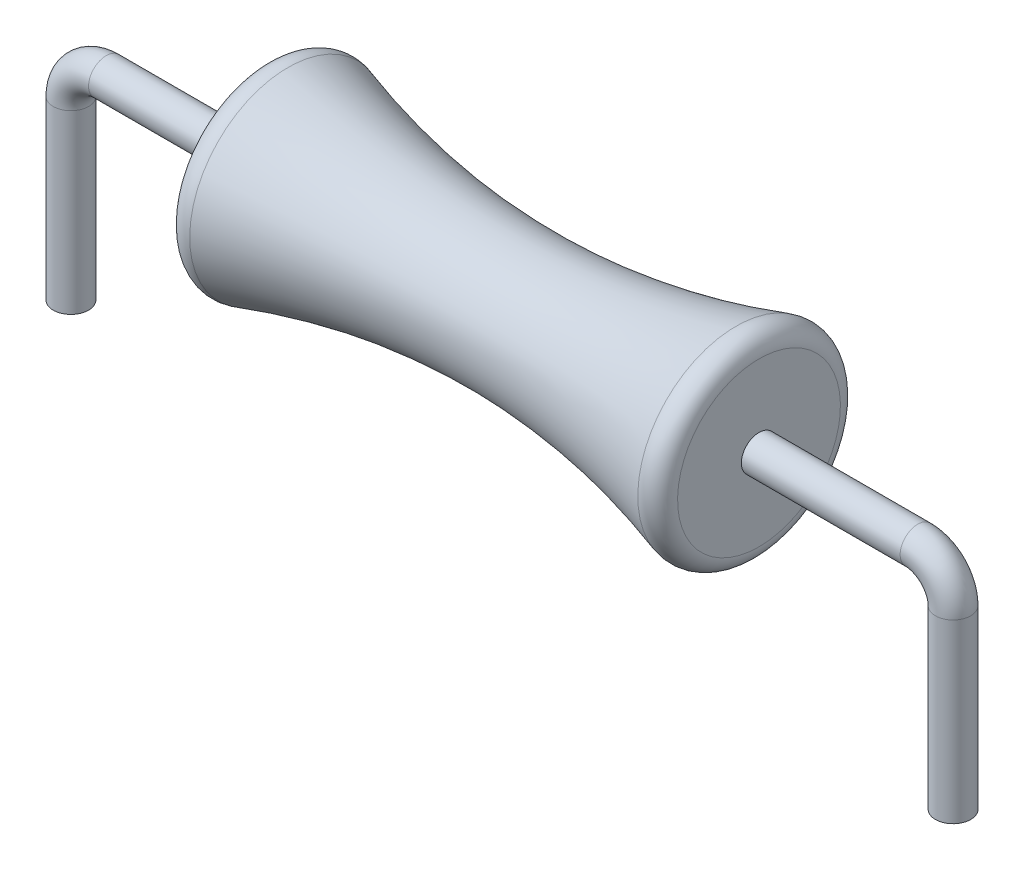
ISO-10303-21;
HEADER;
FILE_DESCRIPTION(('STEP AP214'),'2;1');
FILE_NAME('part.step','',(''),(''),'','','');
FILE_SCHEMA(('AUTOMOTIVE_DESIGN { 1 0 10303 214 1 1 1 1 }'));
ENDSEC;
DATA;
#1=APPLICATION_CONTEXT('core data for automotive mechanical design processes');
#2=APPLICATION_PROTOCOL_DEFINITION('international standard','automotive_design',2000,#1);
#3=PRODUCT_CONTEXT('',#1,'mechanical');
#4=PRODUCT('Part','Part','',(#3));
#5=PRODUCT_RELATED_PRODUCT_CATEGORY('part','',(#4));
#6=PRODUCT_DEFINITION_FORMATION('','',#4);
#7=PRODUCT_DEFINITION_CONTEXT('part definition',#1,'design');
#8=PRODUCT_DEFINITION('design','',#6,#7);
#9=PRODUCT_DEFINITION_SHAPE('','',#8);
#10=(LENGTH_UNIT() NAMED_UNIT(*) SI_UNIT(.MILLI.,.METRE.));
#11=(NAMED_UNIT(*) PLANE_ANGLE_UNIT() SI_UNIT($,.RADIAN.));
#12=(NAMED_UNIT(*) SI_UNIT($,.STERADIAN.) SOLID_ANGLE_UNIT());
#13=UNCERTAINTY_MEASURE_WITH_UNIT(LENGTH_MEASURE(1.E-05),#10,'distance_accuracy_value','');
#14=(GEOMETRIC_REPRESENTATION_CONTEXT(3) GLOBAL_UNCERTAINTY_ASSIGNED_CONTEXT((#13)) GLOBAL_UNIT_ASSIGNED_CONTEXT((#10,
#11,#12)) REPRESENTATION_CONTEXT('',''));
#15=CARTESIAN_POINT('',(0.,0.,0.));
#16=DIRECTION('',(0.,0.,1.));
#17=DIRECTION('',(1.,0.,0.));
#18=AXIS2_PLACEMENT_3D('',#15,#16,#17);
#19=CARTESIAN_POINT('',(3.5,0.,0.));
#20=DIRECTION('',(-1.,0.,0.));
#21=DIRECTION('',(0.,-1.,0.));
#22=AXIS2_PLACEMENT_3D('',#19,#20,#21);
#23=PLANE('',#22);
#24=CARTESIAN_POINT('',(3.5,0.,0.));
#25=DIRECTION('',(-1.,0.,0.));
#26=DIRECTION('',(0.,-1.,0.));
#27=AXIS2_PLACEMENT_3D('',#24,#25,#26);
#28=CIRCLE('',#27,1.15370622549942);
#29=CARTESIAN_POINT('',(3.5,-1.15370622549942,0.));
#30=VERTEX_POINT('',#29);
#31=EDGE_CURVE('E41',#30,#30,#28,.F.);
#32=ORIENTED_EDGE('',*,*,#31,.T.);
#33=EDGE_LOOP('',(#32));
#34=FACE_BOUND('',#33,.T.);
#35=CARTESIAN_POINT('',(3.5,0.,0.));
#36=DIRECTION('',(-1.,0.,0.));
#37=DIRECTION('',(0.,-1.,0.));
#38=AXIS2_PLACEMENT_3D('',#35,#36,#37);
#39=CIRCLE('',#38,0.25);
#40=CARTESIAN_POINT('',(3.5,-0.249999999999999,0.));
#41=VERTEX_POINT('',#40);
#42=EDGE_CURVE('E10',#41,#41,#39,.F.);
#43=ORIENTED_EDGE('',*,*,#42,.F.);
#44=EDGE_LOOP('',(#43));
#45=FACE_BOUND('',#44,.T.);
#46=ADVANCED_FACE('F34',(#34,#45),#23,.F.);
#47=CARTESIAN_POINT('',(-3.5,0.,0.));
#48=DIRECTION('',(1.,0.,0.));
#49=DIRECTION('',(0.,1.,0.));
#50=AXIS2_PLACEMENT_3D('',#47,#48,#49);
#51=PLANE('',#50);
#52=CARTESIAN_POINT('',(-3.5,0.,0.));
#53=DIRECTION('',(1.,0.,0.));
#54=DIRECTION('',(0.,1.,0.));
#55=AXIS2_PLACEMENT_3D('',#52,#53,#54);
#56=CIRCLE('',#55,0.25);
#57=CARTESIAN_POINT('',(-3.5,0.250000000000001,0.));
#58=VERTEX_POINT('',#57);
#59=EDGE_CURVE('E217',#58,#58,#56,.T.);
#60=ORIENTED_EDGE('',*,*,#59,.T.);
#61=EDGE_LOOP('',(#60));
#62=FACE_BOUND('',#61,.T.);
#63=CARTESIAN_POINT('',(-3.5,0.,0.));
#64=DIRECTION('',(1.,0.,0.));
#65=DIRECTION('',(0.,1.,0.));
#66=AXIS2_PLACEMENT_3D('',#63,#64,#65);
#67=CIRCLE('',#66,1.15370622549943);
#68=CARTESIAN_POINT('',(-3.5,1.15370622549943,0.));
#69=VERTEX_POINT('',#68);
#70=EDGE_CURVE('E54',#69,#69,#67,.F.);
#71=ORIENTED_EDGE('',*,*,#70,.T.);
#72=EDGE_LOOP('',(#71));
#73=FACE_BOUND('',#72,.T.);
#74=ADVANCED_FACE('F72',(#62,#73),#51,.F.);
#75=CARTESIAN_POINT('',(3.5,1.5,0.));
#76=CARTESIAN_POINT('',(0.,0.282452634750258,0.));
#77=CARTESIAN_POINT('',(-3.5,1.5,0.));
#78=B_SPLINE_CURVE_WITH_KNOTS('',2,(#75,#76,#77),.UNSPECIFIED.,.F.,.F.,(3,3),(0.,1.),.UNSPECIFIED.);
#79=CARTESIAN_POINT('',(-3.5,0.,0.));
#80=DIRECTION('',(-1.,0.,0.));
#81=AXIS1_PLACEMENT('',#79,#80);
#82=SURFACE_OF_REVOLUTION('',#78,#81);
#83=CARTESIAN_POINT('',(-3.17477004238228,0.,0.));
#84=DIRECTION('',(-1.,0.,0.));
#85=DIRECTION('',(0.,-1.,0.));
#86=AXIS2_PLACEMENT_3D('',#83,#84,#85);
#87=CIRCLE('',#86,1.39211858565896);
#88=CARTESIAN_POINT('',(-3.17477004238228,-1.39211858565896,0.));
#89=VERTEX_POINT('',#88);
#90=EDGE_CURVE('E45',#89,#89,#87,.F.);
#91=ORIENTED_EDGE('',*,*,#90,.T.);
#92=EDGE_LOOP('',(#91));
#93=FACE_BOUND('',#92,.T.);
#94=CARTESIAN_POINT('',(3.1747700423823,0.,0.));
#95=DIRECTION('',(-1.,0.,0.));
#96=DIRECTION('',(0.,-1.,0.));
#97=AXIS2_PLACEMENT_3D('',#94,#95,#96);
#98=CIRCLE('',#97,1.39211858565896);
#99=CARTESIAN_POINT('',(3.1747700423823,-1.39211858565896,0.));
#100=VERTEX_POINT('',#99);
#101=EDGE_CURVE('E49',#100,#100,#98,.T.);
#102=ORIENTED_EDGE('',*,*,#101,.T.);
#103=EDGE_LOOP('',(#102));
#104=FACE_BOUND('',#103,.T.);
#105=ADVANCED_FACE('F67',(#93,#104),#82,.T.);
#106=CARTESIAN_POINT('',(-3.24999999999999,0.,0.));
#107=DIRECTION('',(-1.,0.,0.));
#108=DIRECTION('',(0.,-1.,0.));
#109=AXIS2_PLACEMENT_3D('',#106,#107,#108);
#110=TOROIDAL_SURFACE('',#109,1.15370622549943,0.25);
#111=ORIENTED_EDGE('',*,*,#90,.F.);
#112=EDGE_LOOP('',(#111));
#113=FACE_BOUND('',#112,.T.);
#114=ORIENTED_EDGE('',*,*,#70,.F.);
#115=EDGE_LOOP('',(#114));
#116=FACE_BOUND('',#115,.T.);
#117=ADVANCED_FACE('F71',(#113,#116),#110,.T.);
#118=CARTESIAN_POINT('',(3.25,0.,0.));
#119=DIRECTION('',(-1.,0.,0.));
#120=DIRECTION('',(0.,-1.,0.));
#121=AXIS2_PLACEMENT_3D('',#118,#119,#120);
#122=TOROIDAL_SURFACE('',#121,1.15370622549942,0.25);
#123=ORIENTED_EDGE('',*,*,#31,.F.);
#124=EDGE_LOOP('',(#123));
#125=FACE_BOUND('',#124,.T.);
#126=ORIENTED_EDGE('',*,*,#101,.F.);
#127=EDGE_LOOP('',(#126));
#128=FACE_BOUND('',#127,.T.);
#129=ADVANCED_FACE('F36',(#125,#128),#122,.T.);
#130=CARTESIAN_POINT('',(6.25,-0.500000000000003,0.));
#131=DIRECTION('',(0.,-1.,0.));
#132=DIRECTION('',(1.,0.,0.));
#133=AXIS2_PLACEMENT_3D('',#130,#131,#132);
#134=CYLINDRICAL_SURFACE('',#133,0.25);
#135=CARTESIAN_POINT('',(6.25,-0.500000000000003,0.));
#136=DIRECTION('',(0.,-1.,0.));
#137=DIRECTION('',(1.,0.,0.));
#138=AXIS2_PLACEMENT_3D('',#135,#136,#137);
#139=CIRCLE('',#138,0.25);
#140=CARTESIAN_POINT('',(6.5,-0.500000000000005,0.));
#141=VERTEX_POINT('',#140);
#142=EDGE_CURVE('E205',#141,#141,#139,.T.);
#143=ORIENTED_EDGE('',*,*,#142,.T.);
#144=EDGE_LOOP('',(#143));
#145=FACE_BOUND('',#144,.T.);
#146=CARTESIAN_POINT('',(6.25,-3.,0.));
#147=DIRECTION('',(0.,-1.,0.));
#148=DIRECTION('',(1.,0.,0.));
#149=AXIS2_PLACEMENT_3D('',#146,#147,#148);
#150=CIRCLE('',#149,0.25);
#151=CARTESIAN_POINT('',(6.5,-3.,0.));
#152=VERTEX_POINT('',#151);
#153=EDGE_CURVE('E57',#152,#152,#150,.T.);
#154=ORIENTED_EDGE('',*,*,#153,.F.);
#155=EDGE_LOOP('',(#154));
#156=FACE_BOUND('',#155,.T.);
#157=ADVANCED_FACE('F82',(#145,#156),#134,.T.);
#158=CARTESIAN_POINT('',(5.75,-0.5,0.));
#159=DIRECTION('',(0.,0.,-1.));
#160=DIRECTION('',(-1.,0.,0.));
#161=AXIS2_PLACEMENT_3D('',#158,#159,#160);
#162=TOROIDAL_SURFACE('',#161,0.500000000000001,0.25);
#163=CARTESIAN_POINT('',(5.75,0.,0.));
#164=DIRECTION('',(1.,0.,0.));
#165=DIRECTION('',(0.,1.,0.));
#166=AXIS2_PLACEMENT_3D('',#163,#164,#165);
#167=CIRCLE('',#166,0.25);
#168=CARTESIAN_POINT('',(5.75,0.250000000000001,0.));
#169=VERTEX_POINT('',#168);
#170=EDGE_CURVE('E201',#169,#169,#167,.T.);
#171=CARTESIAN_POINT('',(5.75,-0.5,0.));
#172=DIRECTION('',(0.,0.,-1.));
#173=DIRECTION('',(-1.,0.,0.));
#174=AXIS2_PLACEMENT_3D('',#171,#172,#173);
#175=CIRCLE('',#174,0.750000000000001);
#176=EDGE_CURVE('',#169,#141,#175,.T.);
#177=ORIENTED_EDGE('',*,*,#170,.T.);
#178=ORIENTED_EDGE('',*,*,#142,.F.);
#179=ORIENTED_EDGE('',*,*,#176,.T.);
#180=ORIENTED_EDGE('',*,*,#176,.F.);
#181=EDGE_LOOP('',(#177,#179,#178,#180));
#182=FACE_BOUND('',#181,.T.);
#183=ADVANCED_FACE('F126',(#182),#162,.T.);
#184=CARTESIAN_POINT('',(5.75,0.,0.));
#185=DIRECTION('',(-1.,0.,0.));
#186=DIRECTION('',(0.,0.,1.));
#187=AXIS2_PLACEMENT_3D('',#184,#185,#186);
#188=CYLINDRICAL_SURFACE('',#187,0.25);
#189=ORIENTED_EDGE('',*,*,#170,.F.);
#190=EDGE_LOOP('',(#189));
#191=FACE_BOUND('',#190,.T.);
#192=ORIENTED_EDGE('',*,*,#42,.T.);
#193=EDGE_LOOP('',(#192));
#194=FACE_BOUND('',#193,.T.);
#195=ADVANCED_FACE('F135',(#191,#194),#188,.T.);
#196=CARTESIAN_POINT('',(6.25,-3.,0.));
#197=DIRECTION('',(0.,-1.,0.));
#198=DIRECTION('',(1.,0.,0.));
#199=AXIS2_PLACEMENT_3D('',#196,#197,#198);
#200=PLANE('',#199);
#201=ORIENTED_EDGE('',*,*,#153,.T.);
#202=EDGE_LOOP('',(#201));
#203=FACE_BOUND('',#202,.T.);
#204=ADVANCED_FACE('F144',(#203),#200,.T.);
#205=CARTESIAN_POINT('',(-6.25,-0.500000000000003,0.));
#206=DIRECTION('',(0.,-1.,0.));
#207=DIRECTION('',(1.,0.,0.));
#208=AXIS2_PLACEMENT_3D('',#205,#206,#207);
#209=CYLINDRICAL_SURFACE('',#208,0.25);
#210=CARTESIAN_POINT('',(-6.25,-0.500000000000003,0.));
#211=DIRECTION('',(0.,1.,0.));
#212=DIRECTION('',(-1.,0.,0.));
#213=AXIS2_PLACEMENT_3D('',#210,#211,#212);
#214=CIRCLE('',#213,0.25);
#215=CARTESIAN_POINT('',(-6.5,-0.500000000000005,0.));
#216=VERTEX_POINT('',#215);
#217=EDGE_CURVE('E202',#216,#216,#214,.T.);
#218=ORIENTED_EDGE('',*,*,#217,.F.);
#219=EDGE_LOOP('',(#218));
#220=FACE_BOUND('',#219,.T.);
#221=CARTESIAN_POINT('',(-6.25,-3.,0.));
#222=DIRECTION('',(0.,1.,0.));
#223=DIRECTION('',(-1.,0.,0.));
#224=AXIS2_PLACEMENT_3D('',#221,#222,#223);
#225=CIRCLE('',#224,0.25);
#226=CARTESIAN_POINT('',(-6.5,-3.,0.));
#227=VERTEX_POINT('',#226);
#228=EDGE_CURVE('E199',#227,#227,#225,.T.);
#229=ORIENTED_EDGE('',*,*,#228,.T.);
#230=EDGE_LOOP('',(#229));
#231=FACE_BOUND('',#230,.T.);
#232=ADVANCED_FACE('F153',(#220,#231),#209,.T.);
#233=CARTESIAN_POINT('',(-5.75,-0.5,0.));
#234=DIRECTION('',(0.,0.,1.));
#235=DIRECTION('',(1.,0.,0.));
#236=AXIS2_PLACEMENT_3D('',#233,#234,#235);
#237=TOROIDAL_SURFACE('',#236,0.500000000000001,0.25);
#238=CARTESIAN_POINT('',(-5.75,0.,0.));
#239=DIRECTION('',(1.,0.,0.));
#240=DIRECTION('',(0.,1.,0.));
#241=AXIS2_PLACEMENT_3D('',#238,#239,#240);
#242=CIRCLE('',#241,0.25);
#243=CARTESIAN_POINT('',(-5.75,0.250000000000001,0.));
#244=VERTEX_POINT('',#243);
#245=EDGE_CURVE('E208',#244,#244,#242,.T.);
#246=CARTESIAN_POINT('',(-5.75,-0.5,0.));
#247=DIRECTION('',(0.,0.,1.));
#248=DIRECTION('',(1.,0.,0.));
#249=AXIS2_PLACEMENT_3D('',#246,#247,#248);
#250=CIRCLE('',#249,0.750000000000001);
#251=EDGE_CURVE('',#244,#216,#250,.T.);
#252=ORIENTED_EDGE('',*,*,#245,.F.);
#253=ORIENTED_EDGE('',*,*,#217,.T.);
#254=ORIENTED_EDGE('',*,*,#251,.T.);
#255=ORIENTED_EDGE('',*,*,#251,.F.);
#256=EDGE_LOOP('',(#252,#254,#253,#255));
#257=FACE_BOUND('',#256,.T.);
#258=ADVANCED_FACE('F163',(#257),#237,.T.);
#259=CARTESIAN_POINT('',(-5.75,0.,0.));
#260=DIRECTION('',(1.,0.,0.));
#261=DIRECTION('',(0.,0.,-1.));
#262=AXIS2_PLACEMENT_3D('',#259,#260,#261);
#263=CYLINDRICAL_SURFACE('',#262,0.25);
#264=ORIENTED_EDGE('',*,*,#245,.T.);
#265=EDGE_LOOP('',(#264));
#266=FACE_BOUND('',#265,.T.);
#267=ORIENTED_EDGE('',*,*,#59,.F.);
#268=EDGE_LOOP('',(#267));
#269=FACE_BOUND('',#268,.T.);
#270=ADVANCED_FACE('F170',(#266,#269),#263,.T.);
#271=CARTESIAN_POINT('',(-6.25,-3.,0.));
#272=DIRECTION('',(0.,-1.,0.));
#273=DIRECTION('',(-1.,0.,0.));
#274=AXIS2_PLACEMENT_3D('',#271,#272,#273);
#275=PLANE('',#274);
#276=ORIENTED_EDGE('',*,*,#228,.F.);
#277=EDGE_LOOP('',(#276));
#278=FACE_BOUND('',#277,.T.);
#279=ADVANCED_FACE('F178',(#278),#275,.T.);
#280=CLOSED_SHELL('',(#46,#74,#105,#117,#129,#157,#183,#195,#204,#232,#258,#270,#279));
#281=MANIFOLD_SOLID_BREP('B2',#280);
#282=ADVANCED_BREP_SHAPE_REPRESENTATION('',(#18,#281),#14);
#283=SHAPE_DEFINITION_REPRESENTATION(#9,#282);
ENDSEC;
END-ISO-10303-21;
